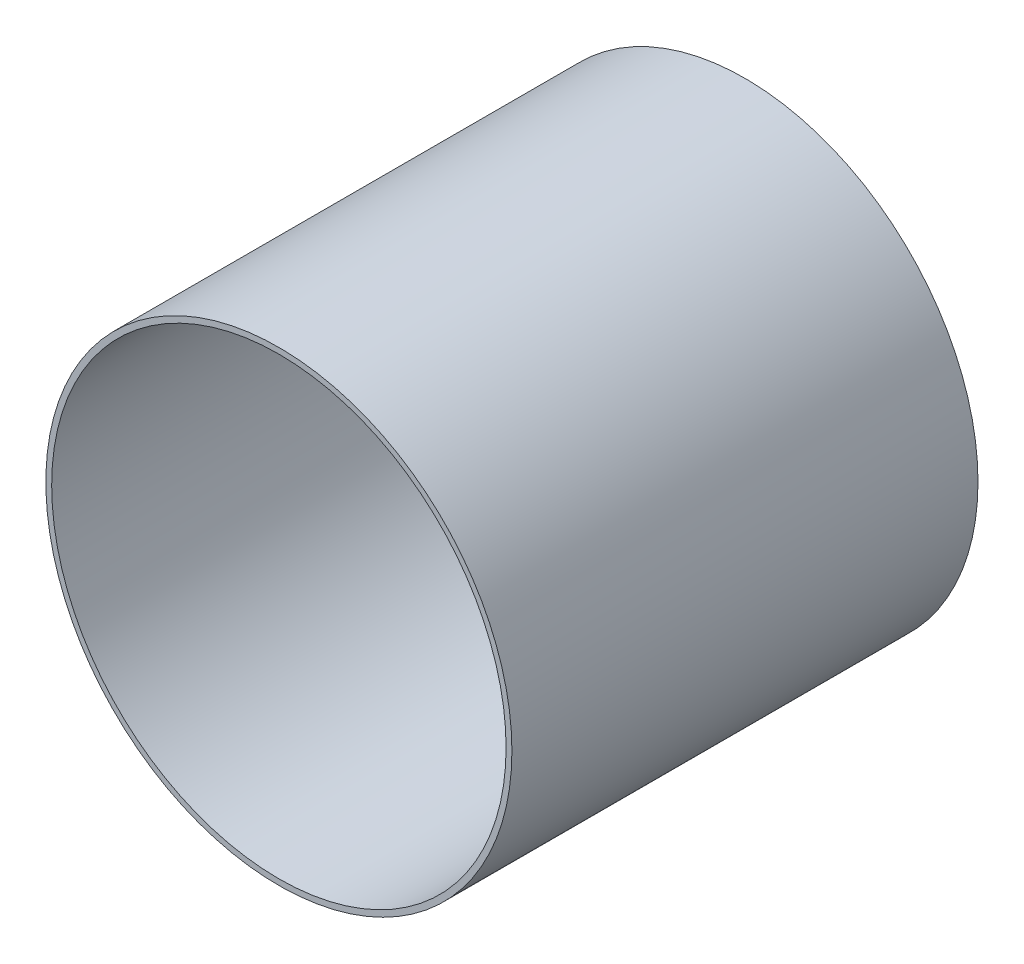
ISO-10303-21;
HEADER;
FILE_DESCRIPTION(('STEP AP214'),'2;1');
FILE_NAME('part.step','',(''),(''),'','','');
FILE_SCHEMA(('AUTOMOTIVE_DESIGN { 1 0 10303 214 1 1 1 1 }'));
ENDSEC;
DATA;
#1=APPLICATION_CONTEXT('core data for automotive mechanical design processes');
#2=APPLICATION_PROTOCOL_DEFINITION('international standard','automotive_design',2000,#1);
#3=PRODUCT_CONTEXT('',#1,'mechanical');
#4=PRODUCT('Part','Part','',(#3));
#5=PRODUCT_RELATED_PRODUCT_CATEGORY('part','',(#4));
#6=PRODUCT_DEFINITION_FORMATION('','',#4);
#7=PRODUCT_DEFINITION_CONTEXT('part definition',#1,'design');
#8=PRODUCT_DEFINITION('design','',#6,#7);
#9=PRODUCT_DEFINITION_SHAPE('','',#8);
#10=(LENGTH_UNIT() NAMED_UNIT(*) SI_UNIT(.MILLI.,.METRE.));
#11=(NAMED_UNIT(*) PLANE_ANGLE_UNIT() SI_UNIT($,.RADIAN.));
#12=(NAMED_UNIT(*) SI_UNIT($,.STERADIAN.) SOLID_ANGLE_UNIT());
#13=UNCERTAINTY_MEASURE_WITH_UNIT(LENGTH_MEASURE(1.E-05),#10,'distance_accuracy_value','');
#14=(GEOMETRIC_REPRESENTATION_CONTEXT(3) GLOBAL_UNCERTAINTY_ASSIGNED_CONTEXT((#13)) GLOBAL_UNIT_ASSIGNED_CONTEXT((#10,
#11,#12)) REPRESENTATION_CONTEXT('',''));
#15=CARTESIAN_POINT('',(0.,0.,0.));
#16=DIRECTION('',(0.,0.,1.));
#17=DIRECTION('',(1.,0.,0.));
#18=AXIS2_PLACEMENT_3D('',#15,#16,#17);
#19=CARTESIAN_POINT('',(0.,0.,40.));
#20=DIRECTION('',(0.,0.,1.));
#21=DIRECTION('',(1.,0.,0.));
#22=AXIS2_PLACEMENT_3D('',#19,#20,#21);
#23=PLANE('',#22);
#24=CARTESIAN_POINT('',(0.,0.,40.));
#25=DIRECTION('',(0.,0.,1.));
#26=DIRECTION('',(1.,0.,0.));
#27=AXIS2_PLACEMENT_3D('',#24,#25,#26);
#28=CIRCLE('',#27,20.);
#29=CARTESIAN_POINT('',(20.,0.,40.));
#30=VERTEX_POINT('',#29);
#31=EDGE_CURVE('E10',#30,#30,#28,.T.);
#32=ORIENTED_EDGE('',*,*,#31,.T.);
#33=EDGE_LOOP('',(#32));
#34=FACE_BOUND('',#33,.T.);
#35=CARTESIAN_POINT('',(0.,0.,40.));
#36=DIRECTION('',(0.,0.,1.));
#37=DIRECTION('',(1.,0.,0.));
#38=AXIS2_PLACEMENT_3D('',#35,#36,#37);
#39=CIRCLE('',#38,19.5);
#40=CARTESIAN_POINT('',(19.5,0.,40.));
#41=VERTEX_POINT('',#40);
#42=EDGE_CURVE('E42',#41,#41,#39,.T.);
#43=ORIENTED_EDGE('',*,*,#42,.F.);
#44=EDGE_LOOP('',(#43));
#45=FACE_BOUND('',#44,.T.);
#46=ADVANCED_FACE('F31',(#34,#45),#23,.T.);
#47=CARTESIAN_POINT('',(0.,0.,0.));
#48=DIRECTION('',(0.,0.,1.));
#49=DIRECTION('',(1.,0.,0.));
#50=AXIS2_PLACEMENT_3D('',#47,#48,#49);
#51=PLANE('',#50);
#52=CARTESIAN_POINT('',(0.,0.,0.));
#53=DIRECTION('',(0.,0.,1.));
#54=DIRECTION('',(1.,0.,0.));
#55=AXIS2_PLACEMENT_3D('',#52,#53,#54);
#56=CIRCLE('',#55,20.);
#57=CARTESIAN_POINT('',(20.,0.,0.));
#58=VERTEX_POINT('',#57);
#59=EDGE_CURVE('E35',#58,#58,#56,.T.);
#60=ORIENTED_EDGE('',*,*,#59,.F.);
#61=EDGE_LOOP('',(#60));
#62=FACE_BOUND('',#61,.T.);
#63=CARTESIAN_POINT('',(0.,0.,0.));
#64=DIRECTION('',(0.,0.,1.));
#65=DIRECTION('',(1.,0.,0.));
#66=AXIS2_PLACEMENT_3D('',#63,#64,#65);
#67=CIRCLE('',#66,19.5);
#68=CARTESIAN_POINT('',(19.5,0.,0.));
#69=VERTEX_POINT('',#68);
#70=EDGE_CURVE('E44',#69,#69,#67,.T.);
#71=ORIENTED_EDGE('',*,*,#70,.T.);
#72=EDGE_LOOP('',(#71));
#73=FACE_BOUND('',#72,.T.);
#74=ADVANCED_FACE('F54',(#62,#73),#51,.F.);
#75=CARTESIAN_POINT('',(0.,0.,40.));
#76=DIRECTION('',(0.,0.,-1.));
#77=DIRECTION('',(-1.,0.,0.));
#78=AXIS2_PLACEMENT_3D('',#75,#76,#77);
#79=CYLINDRICAL_SURFACE('',#78,20.);
#80=ORIENTED_EDGE('',*,*,#31,.F.);
#81=EDGE_LOOP('',(#80));
#82=FACE_BOUND('',#81,.T.);
#83=ORIENTED_EDGE('',*,*,#59,.T.);
#84=EDGE_LOOP('',(#83));
#85=FACE_BOUND('',#84,.T.);
#86=ADVANCED_FACE('F33',(#82,#85),#79,.T.);
#87=CARTESIAN_POINT('',(0.,0.,40.));
#88=DIRECTION('',(0.,0.,-1.));
#89=DIRECTION('',(-1.,0.,0.));
#90=AXIS2_PLACEMENT_3D('',#87,#88,#89);
#91=CYLINDRICAL_SURFACE('',#90,19.5);
#92=ORIENTED_EDGE('',*,*,#42,.T.);
#93=EDGE_LOOP('',(#92));
#94=FACE_BOUND('',#93,.T.);
#95=ORIENTED_EDGE('',*,*,#70,.F.);
#96=EDGE_LOOP('',(#95));
#97=FACE_BOUND('',#96,.T.);
#98=ADVANCED_FACE('F50',(#94,#97),#91,.F.);
#99=CLOSED_SHELL('',(#46,#74,#86,#98));
#100=MANIFOLD_SOLID_BREP('B2',#99);
#101=ADVANCED_BREP_SHAPE_REPRESENTATION('',(#18,#100),#14);
#102=SHAPE_DEFINITION_REPRESENTATION(#9,#101);
ENDSEC;
END-ISO-10303-21;
